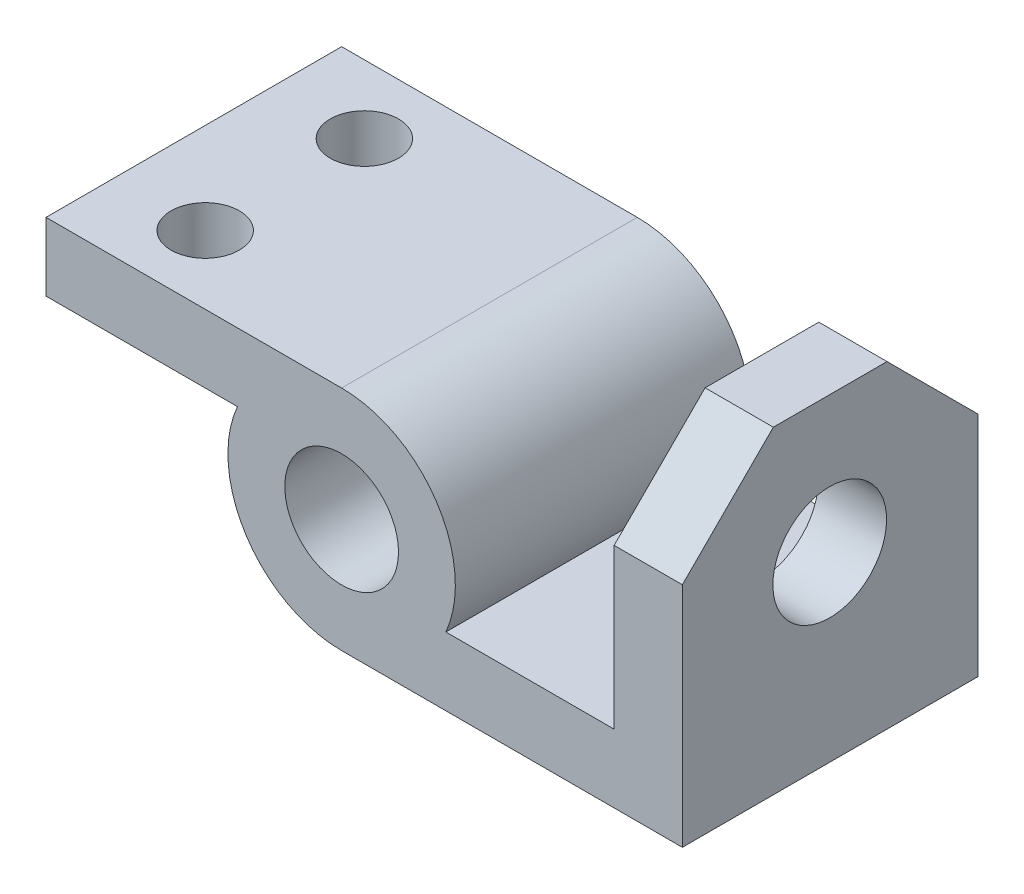
ISO-10303-21;
HEADER;
FILE_DESCRIPTION(('STEP AP214'),'2;1');
FILE_NAME('part.step','',(''),(''),'','','');
FILE_SCHEMA(('AUTOMOTIVE_DESIGN { 1 0 10303 214 1 1 1 1 }'));
ENDSEC;
DATA;
#1=APPLICATION_CONTEXT('core data for automotive mechanical design processes');
#2=APPLICATION_PROTOCOL_DEFINITION('international standard','automotive_design',2000,#1);
#3=PRODUCT_CONTEXT('',#1,'mechanical');
#4=PRODUCT('Part','Part','',(#3));
#5=PRODUCT_RELATED_PRODUCT_CATEGORY('part','',(#4));
#6=PRODUCT_DEFINITION_FORMATION('','',#4);
#7=PRODUCT_DEFINITION_CONTEXT('part definition',#1,'design');
#8=PRODUCT_DEFINITION('design','',#6,#7);
#9=PRODUCT_DEFINITION_SHAPE('','',#8);
#10=(LENGTH_UNIT() NAMED_UNIT(*) SI_UNIT(.MILLI.,.METRE.));
#11=(NAMED_UNIT(*) PLANE_ANGLE_UNIT() SI_UNIT($,.RADIAN.));
#12=(NAMED_UNIT(*) SI_UNIT($,.STERADIAN.) SOLID_ANGLE_UNIT());
#13=UNCERTAINTY_MEASURE_WITH_UNIT(LENGTH_MEASURE(1.E-05),#10,'distance_accuracy_value','');
#14=(GEOMETRIC_REPRESENTATION_CONTEXT(3) GLOBAL_UNCERTAINTY_ASSIGNED_CONTEXT((#13)) GLOBAL_UNIT_ASSIGNED_CONTEXT((#10,
#11,#12)) REPRESENTATION_CONTEXT('',''));
#15=CARTESIAN_POINT('',(0.,0.,0.));
#16=DIRECTION('',(0.,0.,1.));
#17=DIRECTION('',(1.,0.,0.));
#18=AXIS2_PLACEMENT_3D('',#15,#16,#17);
#19=CARTESIAN_POINT('',(0.,0.,32.5));
#20=DIRECTION('',(0.,0.,-1.));
#21=DIRECTION('',(-1.,0.,0.));
#22=AXIS2_PLACEMENT_3D('',#19,#20,#21);
#23=PLANE('',#22);
#24=DIRECTION('',(0.,1.,0.));
#25=VECTOR('',#24,1.);
#26=CARTESIAN_POINT('',(37.4564723130799,22.5000757866109,32.5));
#27=LINE('',#26,#25);
#28=CARTESIAN_POINT('',(37.4564723130798,-12.4999242133891,32.5));
#29=VERTEX_POINT('',#28);
#30=CARTESIAN_POINT('',(37.4564723130799,12.5000757866108,32.5));
#31=VERTEX_POINT('',#30);
#32=EDGE_CURVE('E249',#29,#31,#27,.T.);
#33=ORIENTED_EDGE('',*,*,#32,.T.);
#34=DIRECTION('',(-1.,0.,0.));
#35=VECTOR('',#34,1.);
#36=CARTESIAN_POINT('',(0.,12.5000757866108,32.5));
#37=LINE('',#36,#35);
#38=CARTESIAN_POINT('',(29.9564723130799,12.5000757866108,32.5));
#39=VERTEX_POINT('',#38);
#40=EDGE_CURVE('E11',#31,#39,#37,.T.);
#41=ORIENTED_EDGE('',*,*,#40,.T.);
#42=DIRECTION('',(0.,-1.,0.));
#43=VECTOR('',#42,1.);
#44=CARTESIAN_POINT('',(29.95647231308,-4.99992421338911,32.5));
#45=LINE('',#44,#43);
#46=CARTESIAN_POINT('',(29.95647231308,-4.99992421338911,32.5));
#47=VERTEX_POINT('',#46);
#48=EDGE_CURVE('E247',#39,#47,#45,.T.);
#49=ORIENTED_EDGE('',*,*,#48,.T.);
#50=DIRECTION('',(-1.,0.,0.));
#51=VECTOR('',#50,1.);
#52=CARTESIAN_POINT('',(29.95647231308,-4.99992421338911,32.5));
#53=LINE('',#52,#51);
#54=CARTESIAN_POINT('',(11.4564723130799,-4.99992421338911,32.5));
#55=VERTEX_POINT('',#54);
#56=EDGE_CURVE('E245',#47,#55,#53,.T.);
#57=ORIENTED_EDGE('',*,*,#56,.T.);
#58=CARTESIAN_POINT('',(0.,0.,32.5));
#59=DIRECTION('',(0.,0.,1.));
#60=DIRECTION('',(-1.,0.,0.));
#61=AXIS2_PLACEMENT_3D('',#58,#59,#60);
#62=CIRCLE('',#61,12.5);
#63=CARTESIAN_POINT('',(0.,12.5,32.5));
#64=VERTEX_POINT('',#63);
#65=EDGE_CURVE('E243',#55,#64,#62,.T.);
#66=ORIENTED_EDGE('',*,*,#65,.T.);
#67=DIRECTION('',(-1.,0.,0.));
#68=VECTOR('',#67,1.);
#69=CARTESIAN_POINT('',(0.,12.5,32.5));
#70=LINE('',#69,#68);
#71=CARTESIAN_POINT('',(-32.5,12.5,32.5));
#72=VERTEX_POINT('',#71);
#73=EDGE_CURVE('E145',#64,#72,#70,.T.);
#74=ORIENTED_EDGE('',*,*,#73,.T.);
#75=DIRECTION('',(0.,-1.,0.));
#76=VECTOR('',#75,1.);
#77=CARTESIAN_POINT('',(-32.5,12.5,32.5));
#78=LINE('',#77,#76);
#79=CARTESIAN_POINT('',(-32.5,5.,32.5));
#80=VERTEX_POINT('',#79);
#81=EDGE_CURVE('E140',#72,#80,#78,.T.);
#82=ORIENTED_EDGE('',*,*,#81,.T.);
#83=DIRECTION('',(1.,0.,0.));
#84=VECTOR('',#83,1.);
#85=CARTESIAN_POINT('',(-32.5,5.,32.5));
#86=LINE('',#85,#84);
#87=CARTESIAN_POINT('',(-11.4564392373896,5.,32.5));
#88=VERTEX_POINT('',#87);
#89=EDGE_CURVE('E129',#80,#88,#86,.T.);
#90=ORIENTED_EDGE('',*,*,#89,.T.);
#91=CARTESIAN_POINT('',(0.,0.,32.5));
#92=DIRECTION('',(0.,0.,1.));
#93=DIRECTION('',(-1.,0.,0.));
#94=AXIS2_PLACEMENT_3D('',#91,#92,#93);
#95=CIRCLE('',#94,12.5);
#96=CARTESIAN_POINT('',(-0.043527686920149,-12.4999242133891,32.5));
#97=VERTEX_POINT('',#96);
#98=EDGE_CURVE('E139',#88,#97,#95,.T.);
#99=ORIENTED_EDGE('',*,*,#98,.T.);
#100=DIRECTION('',(1.,0.,0.));
#101=VECTOR('',#100,1.);
#102=CARTESIAN_POINT('',(-0.043527686920149,-12.4999242133891,32.5));
#103=LINE('',#102,#101);
#104=EDGE_CURVE('E232',#97,#29,#103,.T.);
#105=ORIENTED_EDGE('',*,*,#104,.T.);
#106=EDGE_LOOP('',(#33,#41,#49,#57,#66,#74,#82,#90,#99,#105));
#107=FACE_BOUND('',#106,.T.);
#108=CARTESIAN_POINT('',(0.,0.,32.5));
#109=DIRECTION('',(0.,0.,1.));
#110=DIRECTION('',(1.,0.,0.));
#111=AXIS2_PLACEMENT_3D('',#108,#109,#110);
#112=CIRCLE('',#111,6.25);
#113=CARTESIAN_POINT('',(6.25,0.,32.5));
#114=VERTEX_POINT('',#113);
#115=EDGE_CURVE('E241',#114,#114,#112,.T.);
#116=ORIENTED_EDGE('',*,*,#115,.F.);
#117=EDGE_LOOP('',(#116));
#118=FACE_BOUND('',#117,.T.);
#119=ADVANCED_FACE('F35',(#107,#118),#23,.F.);
#120=CARTESIAN_POINT('',(0.,0.,0.));
#121=DIRECTION('',(0.,0.,-1.));
#122=DIRECTION('',(-1.,0.,0.));
#123=AXIS2_PLACEMENT_3D('',#120,#121,#122);
#124=PLANE('',#123);
#125=DIRECTION('',(0.,-1.,0.));
#126=VECTOR('',#125,1.);
#127=CARTESIAN_POINT('',(29.95647231308,-4.99992421338911,0.));
#128=LINE('',#127,#126);
#129=CARTESIAN_POINT('',(29.9564723130799,12.5000757866108,0.));
#130=VERTEX_POINT('',#129);
#131=CARTESIAN_POINT('',(29.95647231308,-4.99992421338911,0.));
#132=VERTEX_POINT('',#131);
#133=EDGE_CURVE('E198',#130,#132,#128,.T.);
#134=ORIENTED_EDGE('',*,*,#133,.F.);
#135=DIRECTION('',(1.,0.,0.));
#136=VECTOR('',#135,1.);
#137=CARTESIAN_POINT('',(37.4564723130799,12.5000757866108,0.));
#138=LINE('',#137,#136);
#139=CARTESIAN_POINT('',(37.4564723130799,12.5000757866108,0.));
#140=VERTEX_POINT('',#139);
#141=EDGE_CURVE('E59',#130,#140,#138,.T.);
#142=ORIENTED_EDGE('',*,*,#141,.T.);
#143=DIRECTION('',(0.,1.,0.));
#144=VECTOR('',#143,1.);
#145=CARTESIAN_POINT('',(37.4564723130799,22.5000757866109,0.));
#146=LINE('',#145,#144);
#147=CARTESIAN_POINT('',(37.4564723130798,-12.4999242133891,0.));
#148=VERTEX_POINT('',#147);
#149=EDGE_CURVE('E183',#148,#140,#146,.T.);
#150=ORIENTED_EDGE('',*,*,#149,.F.);
#151=DIRECTION('',(1.,0.,0.));
#152=VECTOR('',#151,1.);
#153=CARTESIAN_POINT('',(-0.043527686920149,-12.4999242133891,0.));
#154=LINE('',#153,#152);
#155=CARTESIAN_POINT('',(-0.043527686920149,-12.4999242133891,0.));
#156=VERTEX_POINT('',#155);
#157=EDGE_CURVE('E208',#156,#148,#154,.T.);
#158=ORIENTED_EDGE('',*,*,#157,.F.);
#159=CARTESIAN_POINT('',(0.,0.,0.));
#160=DIRECTION('',(0.,0.,1.));
#161=DIRECTION('',(-1.,0.,0.));
#162=AXIS2_PLACEMENT_3D('',#159,#160,#161);
#163=CIRCLE('',#162,12.5);
#164=CARTESIAN_POINT('',(-11.4564392373896,5.,0.));
#165=VERTEX_POINT('',#164);
#166=EDGE_CURVE('E235',#165,#156,#163,.T.);
#167=ORIENTED_EDGE('',*,*,#166,.F.);
#168=DIRECTION('',(1.,0.,0.));
#169=VECTOR('',#168,1.);
#170=CARTESIAN_POINT('',(-32.5,5.,0.));
#171=LINE('',#170,#169);
#172=CARTESIAN_POINT('',(-32.5,5.,0.));
#173=VERTEX_POINT('',#172);
#174=EDGE_CURVE('E236',#173,#165,#171,.T.);
#175=ORIENTED_EDGE('',*,*,#174,.F.);
#176=DIRECTION('',(0.,-1.,0.));
#177=VECTOR('',#176,1.);
#178=CARTESIAN_POINT('',(-32.5,12.5,0.));
#179=LINE('',#178,#177);
#180=CARTESIAN_POINT('',(-32.5,12.5,0.));
#181=VERTEX_POINT('',#180);
#182=EDGE_CURVE('E153',#181,#173,#179,.T.);
#183=ORIENTED_EDGE('',*,*,#182,.F.);
#184=DIRECTION('',(-1.,0.,0.));
#185=VECTOR('',#184,1.);
#186=CARTESIAN_POINT('',(0.,12.5,0.));
#187=LINE('',#186,#185);
#188=CARTESIAN_POINT('',(0.,12.5,0.));
#189=VERTEX_POINT('',#188);
#190=EDGE_CURVE('E149',#189,#181,#187,.T.);
#191=ORIENTED_EDGE('',*,*,#190,.F.);
#192=CARTESIAN_POINT('',(0.,0.,0.));
#193=DIRECTION('',(0.,0.,1.));
#194=DIRECTION('',(-1.,0.,0.));
#195=AXIS2_PLACEMENT_3D('',#192,#193,#194);
#196=CIRCLE('',#195,12.5);
#197=CARTESIAN_POINT('',(11.4564723130799,-4.99992421338911,0.));
#198=VERTEX_POINT('',#197);
#199=EDGE_CURVE('E206',#198,#189,#196,.T.);
#200=ORIENTED_EDGE('',*,*,#199,.F.);
#201=DIRECTION('',(-1.,0.,0.));
#202=VECTOR('',#201,1.);
#203=CARTESIAN_POINT('',(29.95647231308,-4.99992421338911,0.));
#204=LINE('',#203,#202);
#205=EDGE_CURVE('E204',#132,#198,#204,.T.);
#206=ORIENTED_EDGE('',*,*,#205,.F.);
#207=EDGE_LOOP('',(#134,#142,#150,#158,#167,#175,#183,#191,#200,#206));
#208=FACE_BOUND('',#207,.T.);
#209=CARTESIAN_POINT('',(0.,0.,0.));
#210=DIRECTION('',(0.,0.,1.));
#211=DIRECTION('',(1.,0.,0.));
#212=AXIS2_PLACEMENT_3D('',#209,#210,#211);
#213=CIRCLE('',#212,6.25);
#214=CARTESIAN_POINT('',(6.25,0.,0.));
#215=VERTEX_POINT('',#214);
#216=EDGE_CURVE('E253',#215,#215,#213,.T.);
#217=ORIENTED_EDGE('',*,*,#216,.T.);
#218=EDGE_LOOP('',(#217));
#219=FACE_BOUND('',#218,.T.);
#220=ADVANCED_FACE('F201',(#208,#219),#124,.T.);
#221=CARTESIAN_POINT('',(-32.5,12.5,32.5));
#222=DIRECTION('',(1.,0.,0.));
#223=DIRECTION('',(0.,0.,-1.));
#224=AXIS2_PLACEMENT_3D('',#221,#222,#223);
#225=PLANE('',#224);
#226=ORIENTED_EDGE('',*,*,#182,.T.);
#227=DIRECTION('',(0.,0.,-1.));
#228=VECTOR('',#227,1.);
#229=CARTESIAN_POINT('',(-32.5,5.,32.5));
#230=LINE('',#229,#228);
#231=EDGE_CURVE('E133',#80,#173,#230,.T.);
#232=ORIENTED_EDGE('',*,*,#231,.F.);
#233=ORIENTED_EDGE('',*,*,#81,.F.);
#234=DIRECTION('',(0.,0.,-1.));
#235=VECTOR('',#234,1.);
#236=CARTESIAN_POINT('',(-32.5,12.5,32.5));
#237=LINE('',#236,#235);
#238=EDGE_CURVE('E214',#72,#181,#237,.T.);
#239=ORIENTED_EDGE('',*,*,#238,.T.);
#240=EDGE_LOOP('',(#226,#232,#233,#239));
#241=FACE_BOUND('',#240,.T.);
#242=ADVANCED_FACE('F151',(#241),#225,.F.);
#243=CARTESIAN_POINT('',(-32.5,5.,32.5));
#244=DIRECTION('',(0.,1.,0.));
#245=DIRECTION('',(0.,0.,1.));
#246=AXIS2_PLACEMENT_3D('',#243,#244,#245);
#247=PLANE('',#246);
#248=CARTESIAN_POINT('',(-22.5,5.,7.5));
#249=DIRECTION('',(0.,1.,0.));
#250=DIRECTION('',(0.,0.,1.));
#251=AXIS2_PLACEMENT_3D('',#248,#249,#250);
#252=CIRCLE('',#251,3.75);
#253=CARTESIAN_POINT('',(-22.5,5.,11.25));
#254=VERTEX_POINT('',#253);
#255=EDGE_CURVE('E169',#254,#254,#252,.T.);
#256=ORIENTED_EDGE('',*,*,#255,.T.);
#257=EDGE_LOOP('',(#256));
#258=FACE_BOUND('',#257,.T.);
#259=CARTESIAN_POINT('',(-22.5,5.,25.));
#260=DIRECTION('',(0.,1.,0.));
#261=DIRECTION('',(0.,0.,1.));
#262=AXIS2_PLACEMENT_3D('',#259,#260,#261);
#263=CIRCLE('',#262,3.75);
#264=CARTESIAN_POINT('',(-22.5,5.,28.75));
#265=VERTEX_POINT('',#264);
#266=EDGE_CURVE('E165',#265,#265,#263,.T.);
#267=ORIENTED_EDGE('',*,*,#266,.T.);
#268=EDGE_LOOP('',(#267));
#269=FACE_BOUND('',#268,.T.);
#270=ORIENTED_EDGE('',*,*,#174,.T.);
#271=DIRECTION('',(0.,0.,-1.));
#272=VECTOR('',#271,1.);
#273=CARTESIAN_POINT('',(-11.4564392373896,5.,32.5));
#274=LINE('',#273,#272);
#275=EDGE_CURVE('E136',#88,#165,#274,.T.);
#276=ORIENTED_EDGE('',*,*,#275,.F.);
#277=ORIENTED_EDGE('',*,*,#89,.F.);
#278=ORIENTED_EDGE('',*,*,#231,.T.);
#279=EDGE_LOOP('',(#270,#276,#277,#278));
#280=FACE_BOUND('',#279,.T.);
#281=ADVANCED_FACE('F131',(#258,#269,#280),#247,.F.);
#282=CARTESIAN_POINT('',(0.,0.,32.5));
#283=DIRECTION('',(0.,0.,-1.));
#284=DIRECTION('',(-1.,0.,0.));
#285=AXIS2_PLACEMENT_3D('',#282,#283,#284);
#286=CYLINDRICAL_SURFACE('',#285,12.5);
#287=ORIENTED_EDGE('',*,*,#166,.T.);
#288=DIRECTION('',(0.,0.,-1.));
#289=VECTOR('',#288,1.);
#290=CARTESIAN_POINT('',(-0.043527686920149,-12.4999242133891,32.5));
#291=LINE('',#290,#289);
#292=EDGE_CURVE('E158',#97,#156,#291,.T.);
#293=ORIENTED_EDGE('',*,*,#292,.F.);
#294=ORIENTED_EDGE('',*,*,#98,.F.);
#295=ORIENTED_EDGE('',*,*,#275,.T.);
#296=EDGE_LOOP('',(#287,#293,#294,#295));
#297=FACE_BOUND('',#296,.T.);
#298=ADVANCED_FACE('F304',(#297),#286,.T.);
#299=CARTESIAN_POINT('',(-0.043527686920149,-12.4999242133891,32.5));
#300=DIRECTION('',(0.,1.,0.));
#301=DIRECTION('',(0.,0.,1.));
#302=AXIS2_PLACEMENT_3D('',#299,#300,#301);
#303=PLANE('',#302);
#304=ORIENTED_EDGE('',*,*,#157,.T.);
#305=DIRECTION('',(0.,0.,-1.));
#306=VECTOR('',#305,1.);
#307=CARTESIAN_POINT('',(37.4564723130798,-12.4999242133891,32.5));
#308=LINE('',#307,#306);
#309=EDGE_CURVE('E191',#29,#148,#308,.T.);
#310=ORIENTED_EDGE('',*,*,#309,.F.);
#311=ORIENTED_EDGE('',*,*,#104,.F.);
#312=ORIENTED_EDGE('',*,*,#292,.T.);
#313=EDGE_LOOP('',(#304,#310,#311,#312));
#314=FACE_BOUND('',#313,.T.);
#315=ADVANCED_FACE('F230',(#314),#303,.F.);
#316=CARTESIAN_POINT('',(37.4564723130799,22.5000757866109,32.5));
#317=DIRECTION('',(-1.,0.,0.));
#318=DIRECTION('',(0.,-1.,0.));
#319=AXIS2_PLACEMENT_3D('',#316,#317,#318);
#320=PLANE('',#319);
#321=CARTESIAN_POINT('',(37.4564723130799,7.50007578661089,16.3));
#322=DIRECTION('',(1.,0.,0.));
#323=DIRECTION('',(0.,1.,0.));
#324=AXIS2_PLACEMENT_3D('',#321,#322,#323);
#325=CIRCLE('',#324,6.25);
#326=CARTESIAN_POINT('',(37.4564723130799,13.7500757866109,16.3));
#327=VERTEX_POINT('',#326);
#328=EDGE_CURVE('E262',#327,#327,#325,.T.);
#329=ORIENTED_EDGE('',*,*,#328,.F.);
#330=EDGE_LOOP('',(#329));
#331=FACE_BOUND('',#330,.T.);
#332=ORIENTED_EDGE('',*,*,#149,.T.);
#333=DIRECTION('',(0.,0.707106781186548,0.707106781186548));
#334=VECTOR('',#333,1.);
#335=CARTESIAN_POINT('',(37.4564723130799,22.5000757866109,10.));
#336=LINE('',#335,#334);
#337=CARTESIAN_POINT('',(37.4564723130799,22.5000757866109,10.));
#338=VERTEX_POINT('',#337);
#339=EDGE_CURVE('E44',#140,#338,#336,.T.);
#340=ORIENTED_EDGE('',*,*,#339,.T.);
#341=DIRECTION('',(0.,0.,-1.));
#342=VECTOR('',#341,1.);
#343=CARTESIAN_POINT('',(37.4564723130799,22.5000757866109,32.5));
#344=LINE('',#343,#342);
#345=CARTESIAN_POINT('',(37.4564723130799,22.5000757866109,22.5));
#346=VERTEX_POINT('',#345);
#347=EDGE_CURVE('E181',#346,#338,#344,.T.);
#348=ORIENTED_EDGE('',*,*,#347,.F.);
#349=DIRECTION('',(0.,0.707106781186548,-0.707106781186547));
#350=VECTOR('',#349,1.);
#351=CARTESIAN_POINT('',(37.4564723130799,12.5000757866108,32.5));
#352=LINE('',#351,#350);
#353=EDGE_CURVE('E51',#346,#31,#352,.F.);
#354=ORIENTED_EDGE('',*,*,#353,.T.);
#355=ORIENTED_EDGE('',*,*,#32,.F.);
#356=ORIENTED_EDGE('',*,*,#309,.T.);
#357=EDGE_LOOP('',(#332,#340,#348,#354,#355,#356));
#358=FACE_BOUND('',#357,.T.);
#359=ADVANCED_FACE('F180',(#331,#358),#320,.F.);
#360=CARTESIAN_POINT('',(29.9564723130799,22.5000757866109,32.5));
#361=DIRECTION('',(0.,-1.,0.));
#362=DIRECTION('',(0.,0.,-1.));
#363=AXIS2_PLACEMENT_3D('',#360,#361,#362);
#364=PLANE('',#363);
#365=ORIENTED_EDGE('',*,*,#347,.T.);
#366=DIRECTION('',(-1.,0.,0.));
#367=VECTOR('',#366,1.);
#368=CARTESIAN_POINT('',(29.9564723130799,22.5000757866109,10.));
#369=LINE('',#368,#367);
#370=CARTESIAN_POINT('',(29.9564723130799,22.5000757866109,10.));
#371=VERTEX_POINT('',#370);
#372=EDGE_CURVE('E156',#338,#371,#369,.T.);
#373=ORIENTED_EDGE('',*,*,#372,.T.);
#374=DIRECTION('',(0.,0.,-1.));
#375=VECTOR('',#374,1.);
#376=CARTESIAN_POINT('',(29.9564723130799,22.5000757866109,32.5));
#377=LINE('',#376,#375);
#378=CARTESIAN_POINT('',(29.9564723130799,22.5000757866109,22.5));
#379=VERTEX_POINT('',#378);
#380=EDGE_CURVE('E192',#379,#371,#377,.T.);
#381=ORIENTED_EDGE('',*,*,#380,.F.);
#382=DIRECTION('',(1.,0.,0.));
#383=VECTOR('',#382,1.);
#384=CARTESIAN_POINT('',(29.9564723130799,22.5000757866109,22.5));
#385=LINE('',#384,#383);
#386=EDGE_CURVE('E154',#379,#346,#385,.T.);
#387=ORIENTED_EDGE('',*,*,#386,.T.);
#388=EDGE_LOOP('',(#365,#373,#381,#387));
#389=FACE_BOUND('',#388,.T.);
#390=ADVANCED_FACE('F187',(#389),#364,.F.);
#391=CARTESIAN_POINT('',(29.95647231308,-4.99992421338911,32.5));
#392=DIRECTION('',(1.,0.,0.));
#393=DIRECTION('',(0.,1.,0.));
#394=AXIS2_PLACEMENT_3D('',#391,#392,#393);
#395=PLANE('',#394);
#396=CARTESIAN_POINT('',(29.9564723130799,7.50007578661089,16.3));
#397=DIRECTION('',(1.,0.,0.));
#398=DIRECTION('',(0.,1.,0.));
#399=AXIS2_PLACEMENT_3D('',#396,#397,#398);
#400=CIRCLE('',#399,6.25);
#401=CARTESIAN_POINT('',(29.9564723130799,13.7500757866109,16.3));
#402=VERTEX_POINT('',#401);
#403=EDGE_CURVE('E166',#402,#402,#400,.F.);
#404=ORIENTED_EDGE('',*,*,#403,.F.);
#405=EDGE_LOOP('',(#404));
#406=FACE_BOUND('',#405,.T.);
#407=ORIENTED_EDGE('',*,*,#380,.T.);
#408=DIRECTION('',(0.,-0.707106781186548,-0.707106781186548));
#409=VECTOR('',#408,1.);
#410=CARTESIAN_POINT('',(29.9564723130799,22.5000757866109,10.));
#411=LINE('',#410,#409);
#412=EDGE_CURVE('E175',#371,#130,#411,.T.);
#413=ORIENTED_EDGE('',*,*,#412,.T.);
#414=ORIENTED_EDGE('',*,*,#133,.T.);
#415=DIRECTION('',(0.,0.,-1.));
#416=VECTOR('',#415,1.);
#417=CARTESIAN_POINT('',(29.95647231308,-4.99992421338911,32.5));
#418=LINE('',#417,#416);
#419=EDGE_CURVE('E222',#47,#132,#418,.T.);
#420=ORIENTED_EDGE('',*,*,#419,.F.);
#421=ORIENTED_EDGE('',*,*,#48,.F.);
#422=DIRECTION('',(0.,-0.707106781186548,0.707106781186547));
#423=VECTOR('',#422,1.);
#424=CARTESIAN_POINT('',(29.9564723130799,12.5000757866109,32.5));
#425=LINE('',#424,#423);
#426=EDGE_CURVE('E173',#39,#379,#425,.F.);
#427=ORIENTED_EDGE('',*,*,#426,.T.);
#428=EDGE_LOOP('',(#407,#413,#414,#420,#421,#427));
#429=FACE_BOUND('',#428,.T.);
#430=ADVANCED_FACE('F196',(#406,#429),#395,.F.);
#431=CARTESIAN_POINT('',(29.95647231308,-4.99992421338911,32.5));
#432=DIRECTION('',(0.,-1.,0.));
#433=DIRECTION('',(1.,0.,0.));
#434=AXIS2_PLACEMENT_3D('',#431,#432,#433);
#435=PLANE('',#434);
#436=ORIENTED_EDGE('',*,*,#205,.T.);
#437=DIRECTION('',(0.,0.,-1.));
#438=VECTOR('',#437,1.);
#439=CARTESIAN_POINT('',(11.4564723130799,-4.99992421338911,32.5));
#440=LINE('',#439,#438);
#441=EDGE_CURVE('E219',#55,#198,#440,.T.);
#442=ORIENTED_EDGE('',*,*,#441,.F.);
#443=ORIENTED_EDGE('',*,*,#56,.F.);
#444=ORIENTED_EDGE('',*,*,#419,.T.);
#445=EDGE_LOOP('',(#436,#442,#443,#444));
#446=FACE_BOUND('',#445,.T.);
#447=ADVANCED_FACE('F271',(#446),#435,.F.);
#448=CARTESIAN_POINT('',(0.,0.,32.5));
#449=DIRECTION('',(0.,0.,-1.));
#450=DIRECTION('',(-1.,0.,0.));
#451=AXIS2_PLACEMENT_3D('',#448,#449,#450);
#452=CYLINDRICAL_SURFACE('',#451,12.5);
#453=ORIENTED_EDGE('',*,*,#199,.T.);
#454=DIRECTION('',(0.,0.,-1.));
#455=VECTOR('',#454,1.);
#456=CARTESIAN_POINT('',(0.,12.5,32.5));
#457=LINE('',#456,#455);
#458=EDGE_CURVE('E216',#64,#189,#457,.T.);
#459=ORIENTED_EDGE('',*,*,#458,.F.);
#460=ORIENTED_EDGE('',*,*,#65,.F.);
#461=ORIENTED_EDGE('',*,*,#441,.T.);
#462=EDGE_LOOP('',(#453,#459,#460,#461));
#463=FACE_BOUND('',#462,.T.);
#464=ADVANCED_FACE('F277',(#463),#452,.T.);
#465=CARTESIAN_POINT('',(0.,12.5,32.5));
#466=DIRECTION('',(0.,-1.,0.));
#467=DIRECTION('',(1.,0.,0.));
#468=AXIS2_PLACEMENT_3D('',#465,#466,#467);
#469=PLANE('',#468);
#470=CARTESIAN_POINT('',(-22.5,12.5,7.5));
#471=DIRECTION('',(0.,-1.,0.));
#472=DIRECTION('',(1.,0.,0.));
#473=AXIS2_PLACEMENT_3D('',#470,#471,#472);
#474=CIRCLE('',#473,3.75);
#475=CARTESIAN_POINT('',(-18.75,12.5,7.5));
#476=VERTEX_POINT('',#475);
#477=EDGE_CURVE('E167',#476,#476,#474,.T.);
#478=ORIENTED_EDGE('',*,*,#477,.T.);
#479=EDGE_LOOP('',(#478));
#480=FACE_BOUND('',#479,.T.);
#481=CARTESIAN_POINT('',(-22.5,12.5,25.));
#482=DIRECTION('',(0.,-1.,0.));
#483=DIRECTION('',(1.,0.,0.));
#484=AXIS2_PLACEMENT_3D('',#481,#482,#483);
#485=CIRCLE('',#484,3.75);
#486=CARTESIAN_POINT('',(-18.75,12.5,25.));
#487=VERTEX_POINT('',#486);
#488=EDGE_CURVE('E162',#487,#487,#485,.T.);
#489=ORIENTED_EDGE('',*,*,#488,.T.);
#490=EDGE_LOOP('',(#489));
#491=FACE_BOUND('',#490,.T.);
#492=ORIENTED_EDGE('',*,*,#190,.T.);
#493=ORIENTED_EDGE('',*,*,#238,.F.);
#494=ORIENTED_EDGE('',*,*,#73,.F.);
#495=ORIENTED_EDGE('',*,*,#458,.T.);
#496=EDGE_LOOP('',(#492,#493,#494,#495));
#497=FACE_BOUND('',#496,.T.);
#498=ADVANCED_FACE('F291',(#480,#491,#497),#469,.F.);
#499=CARTESIAN_POINT('',(0.,0.,32.5));
#500=DIRECTION('',(0.,0.,-1.));
#501=DIRECTION('',(-1.,0.,0.));
#502=AXIS2_PLACEMENT_3D('',#499,#500,#501);
#503=CYLINDRICAL_SURFACE('',#502,6.25);
#504=ORIENTED_EDGE('',*,*,#115,.T.);
#505=EDGE_LOOP('',(#504));
#506=FACE_BOUND('',#505,.T.);
#507=ORIENTED_EDGE('',*,*,#216,.F.);
#508=EDGE_LOOP('',(#507));
#509=FACE_BOUND('',#508,.T.);
#510=ADVANCED_FACE('F288',(#506,#509),#503,.F.);
#511=CARTESIAN_POINT('',(-22.5,-12.4999242133891,25.));
#512=DIRECTION('',(0.,1.,0.));
#513=DIRECTION('',(-1.,0.,0.));
#514=AXIS2_PLACEMENT_3D('',#511,#512,#513);
#515=CYLINDRICAL_SURFACE('',#514,3.75);
#516=ORIENTED_EDGE('',*,*,#488,.F.);
#517=EDGE_LOOP('',(#516));
#518=FACE_BOUND('',#517,.T.);
#519=ORIENTED_EDGE('',*,*,#266,.F.);
#520=EDGE_LOOP('',(#519));
#521=FACE_BOUND('',#520,.T.);
#522=ADVANCED_FACE('F372',(#518,#521),#515,.F.);
#523=CARTESIAN_POINT('',(-22.5,-12.4999242133891,7.5));
#524=DIRECTION('',(0.,1.,0.));
#525=DIRECTION('',(-1.,0.,0.));
#526=AXIS2_PLACEMENT_3D('',#523,#524,#525);
#527=CYLINDRICAL_SURFACE('',#526,3.75);
#528=ORIENTED_EDGE('',*,*,#477,.F.);
#529=EDGE_LOOP('',(#528));
#530=FACE_BOUND('',#529,.T.);
#531=ORIENTED_EDGE('',*,*,#255,.F.);
#532=EDGE_LOOP('',(#531));
#533=FACE_BOUND('',#532,.T.);
#534=ADVANCED_FACE('F316',(#530,#533),#527,.F.);
#535=CARTESIAN_POINT('',(-32.501,7.50007578661092,16.3));
#536=DIRECTION('',(1.,0.,0.));
#537=DIRECTION('',(0.,1.,0.));
#538=AXIS2_PLACEMENT_3D('',#535,#536,#537);
#539=CYLINDRICAL_SURFACE('',#538,6.25);
#540=ORIENTED_EDGE('',*,*,#328,.T.);
#541=EDGE_LOOP('',(#540));
#542=FACE_BOUND('',#541,.T.);
#543=ORIENTED_EDGE('',*,*,#403,.T.);
#544=EDGE_LOOP('',(#543));
#545=FACE_BOUND('',#544,.T.);
#546=ADVANCED_FACE('F268',(#542,#545),#539,.F.);
#547=CARTESIAN_POINT('',(29.9564723130799,22.5000757866109,10.));
#548=DIRECTION('',(0.,0.707106781186547,-0.707106781186547));
#549=DIRECTION('',(1.,0.,0.));
#550=AXIS2_PLACEMENT_3D('',#547,#548,#549);
#551=PLANE('',#550);
#552=ORIENTED_EDGE('',*,*,#339,.F.);
#553=ORIENTED_EDGE('',*,*,#141,.F.);
#554=ORIENTED_EDGE('',*,*,#412,.F.);
#555=ORIENTED_EDGE('',*,*,#372,.F.);
#556=EDGE_LOOP('',(#552,#553,#554,#555));
#557=FACE_BOUND('',#556,.T.);
#558=ADVANCED_FACE('F194',(#557),#551,.T.);
#559=CARTESIAN_POINT('',(0.,12.5000757866108,32.5));
#560=DIRECTION('',(0.,-0.707106781186547,-0.707106781186548));
#561=DIRECTION('',(-1.,0.,0.));
#562=AXIS2_PLACEMENT_3D('',#559,#560,#561);
#563=PLANE('',#562);
#564=ORIENTED_EDGE('',*,*,#353,.F.);
#565=ORIENTED_EDGE('',*,*,#386,.F.);
#566=ORIENTED_EDGE('',*,*,#426,.F.);
#567=ORIENTED_EDGE('',*,*,#40,.F.);
#568=EDGE_LOOP('',(#564,#565,#566,#567));
#569=FACE_BOUND('',#568,.T.);
#570=ADVANCED_FACE('F38',(#569),#563,.F.);
#571=CLOSED_SHELL('',(#119,#220,#242,#281,#298,#315,#359,#390,#430,#447,#464,#498,#510,#522,
#534,#546,#558,#570));
#572=MANIFOLD_SOLID_BREP('B2',#571);
#573=ADVANCED_BREP_SHAPE_REPRESENTATION('',(#18,#572),#14);
#574=SHAPE_DEFINITION_REPRESENTATION(#9,#573);
ENDSEC;
END-ISO-10303-21;
